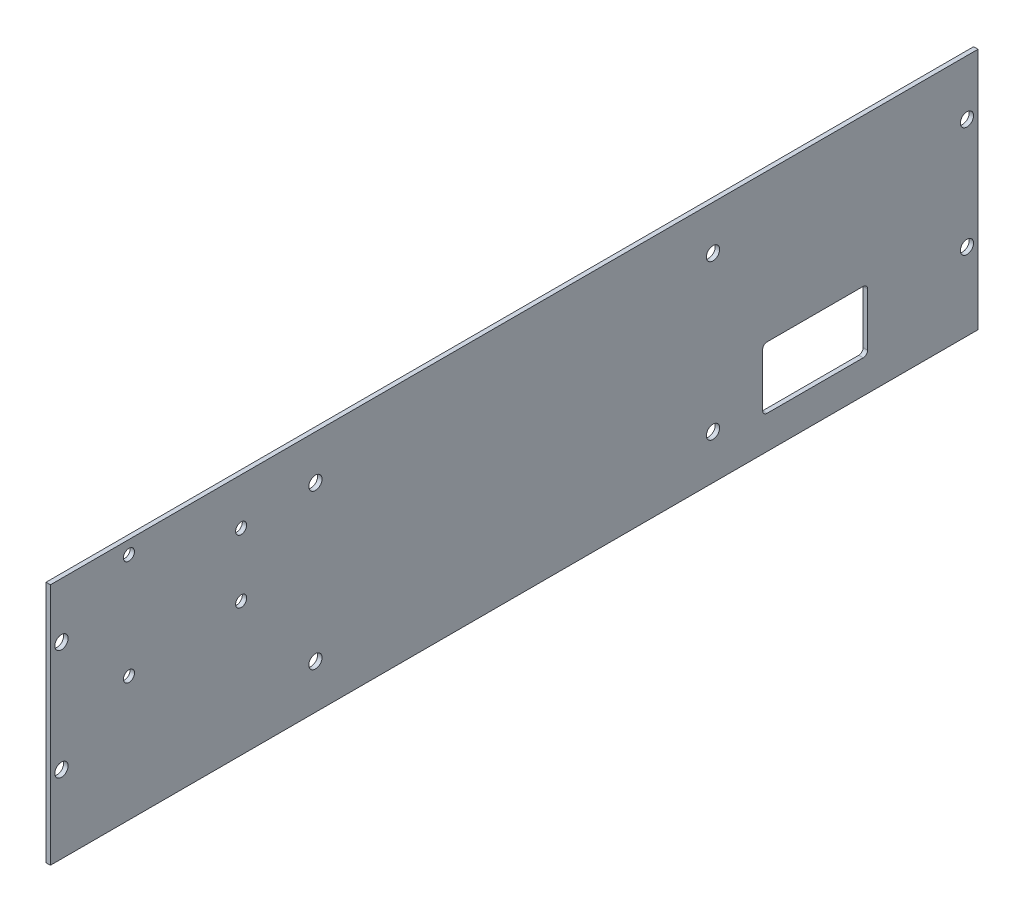
ISO-10303-21;
HEADER;
FILE_DESCRIPTION(('STEP AP214'),'2;1');
FILE_NAME('part.step','',(''),(''),'','','');
FILE_SCHEMA(('AUTOMOTIVE_DESIGN { 1 0 10303 214 1 1 1 1 }'));
ENDSEC;
DATA;
#1=APPLICATION_CONTEXT('core data for automotive mechanical design processes');
#2=APPLICATION_PROTOCOL_DEFINITION('international standard','automotive_design',2000,#1);
#3=PRODUCT_CONTEXT('',#1,'mechanical');
#4=PRODUCT('Part','Part','',(#3));
#5=PRODUCT_RELATED_PRODUCT_CATEGORY('part','',(#4));
#6=PRODUCT_DEFINITION_FORMATION('','',#4);
#7=PRODUCT_DEFINITION_CONTEXT('part definition',#1,'design');
#8=PRODUCT_DEFINITION('design','',#6,#7);
#9=PRODUCT_DEFINITION_SHAPE('','',#8);
#10=(LENGTH_UNIT() NAMED_UNIT(*) SI_UNIT(.MILLI.,.METRE.));
#11=(NAMED_UNIT(*) PLANE_ANGLE_UNIT() SI_UNIT($,.RADIAN.));
#12=(NAMED_UNIT(*) SI_UNIT($,.STERADIAN.) SOLID_ANGLE_UNIT());
#13=UNCERTAINTY_MEASURE_WITH_UNIT(LENGTH_MEASURE(1.E-05),#10,'distance_accuracy_value','');
#14=(GEOMETRIC_REPRESENTATION_CONTEXT(3) GLOBAL_UNCERTAINTY_ASSIGNED_CONTEXT((#13)) GLOBAL_UNIT_ASSIGNED_CONTEXT((#10,
#11,#12)) REPRESENTATION_CONTEXT('',''));
#15=CARTESIAN_POINT('',(0.,0.,0.));
#16=DIRECTION('',(0.,0.,1.));
#17=DIRECTION('',(1.,0.,0.));
#18=AXIS2_PLACEMENT_3D('',#15,#16,#17);
#19=CARTESIAN_POINT('',(-28.0517455341106,100.,394.692172038795));
#20=DIRECTION('',(0.,0.,-1.));
#21=DIRECTION('',(-1.,0.,0.));
#22=AXIS2_PLACEMENT_3D('',#19,#20,#21);
#23=PLANE('',#22);
#24=DIRECTION('',(0.,1.,0.));
#25=VECTOR('',#24,1.);
#26=CARTESIAN_POINT('',(-26.0517455341106,100.,394.692172038795));
#27=LINE('',#26,#25);
#28=CARTESIAN_POINT('',(-26.0517455341106,-10.,394.692172038795));
#29=VERTEX_POINT('',#28);
#30=CARTESIAN_POINT('',(-26.0517455341106,100.,394.692172038795));
#31=VERTEX_POINT('',#30);
#32=EDGE_CURVE('E145',#29,#31,#27,.T.);
#33=ORIENTED_EDGE('',*,*,#32,.T.);
#34=DIRECTION('',(1.,0.,0.));
#35=VECTOR('',#34,1.);
#36=CARTESIAN_POINT('',(-28.0517455341106,100.,394.692172038795));
#37=LINE('',#36,#35);
#38=CARTESIAN_POINT('',(-28.0517455341106,100.,394.692172038795));
#39=VERTEX_POINT('',#38);
#40=EDGE_CURVE('E126',#39,#31,#37,.T.);
#41=ORIENTED_EDGE('',*,*,#40,.F.);
#42=DIRECTION('',(0.,1.,0.));
#43=VECTOR('',#42,1.);
#44=CARTESIAN_POINT('',(-28.0517455341106,100.,394.692172038795));
#45=LINE('',#44,#43);
#46=CARTESIAN_POINT('',(-28.0517455341106,-10.,394.692172038795));
#47=VERTEX_POINT('',#46);
#48=EDGE_CURVE('E133',#47,#39,#45,.T.);
#49=ORIENTED_EDGE('',*,*,#48,.F.);
#50=DIRECTION('',(1.,0.,0.));
#51=VECTOR('',#50,1.);
#52=CARTESIAN_POINT('',(-28.0517455341106,-10.,394.692172038795));
#53=LINE('',#52,#51);
#54=EDGE_CURVE('E290',#47,#29,#53,.T.);
#55=ORIENTED_EDGE('',*,*,#54,.T.);
#56=EDGE_LOOP('',(#33,#41,#49,#55));
#57=FACE_BOUND('',#56,.T.);
#58=ADVANCED_FACE('F33',(#57),#23,.F.);
#59=CARTESIAN_POINT('',(-28.0517455341106,100.,394.692172038795));
#60=DIRECTION('',(0.,-1.,0.));
#61=DIRECTION('',(0.,0.,-1.));
#62=AXIS2_PLACEMENT_3D('',#59,#60,#61);
#63=PLANE('',#62);
#64=DIRECTION('',(0.,0.,-1.));
#65=VECTOR('',#64,1.);
#66=CARTESIAN_POINT('',(-26.0517455341106,100.,394.692172038795));
#67=LINE('',#66,#65);
#68=CARTESIAN_POINT('',(-26.0517455341106,99.9999999999999,-25.3078279612049));
#69=VERTEX_POINT('',#68);
#70=EDGE_CURVE('E292',#31,#69,#67,.T.);
#71=ORIENTED_EDGE('',*,*,#70,.T.);
#72=DIRECTION('',(1.,0.,0.));
#73=VECTOR('',#72,1.);
#74=CARTESIAN_POINT('',(-28.0517455341106,99.9999999999999,-25.3078279612049));
#75=LINE('',#74,#73);
#76=CARTESIAN_POINT('',(-28.0517455341106,99.9999999999999,-25.3078279612049));
#77=VERTEX_POINT('',#76);
#78=EDGE_CURVE('E129',#77,#69,#75,.T.);
#79=ORIENTED_EDGE('',*,*,#78,.F.);
#80=DIRECTION('',(0.,0.,-1.));
#81=VECTOR('',#80,1.);
#82=CARTESIAN_POINT('',(-28.0517455341106,100.,394.692172038795));
#83=LINE('',#82,#81);
#84=EDGE_CURVE('E122',#39,#77,#83,.T.);
#85=ORIENTED_EDGE('',*,*,#84,.F.);
#86=ORIENTED_EDGE('',*,*,#40,.T.);
#87=EDGE_LOOP('',(#71,#79,#85,#86));
#88=FACE_BOUND('',#87,.T.);
#89=ADVANCED_FACE('F124',(#88),#63,.F.);
#90=CARTESIAN_POINT('',(-28.0517455341106,99.9999999999999,-25.3078279612049));
#91=DIRECTION('',(0.,0.,1.));
#92=DIRECTION('',(0.,-1.,0.));
#93=AXIS2_PLACEMENT_3D('',#90,#91,#92);
#94=PLANE('',#93);
#95=DIRECTION('',(0.,-1.,0.));
#96=VECTOR('',#95,1.);
#97=CARTESIAN_POINT('',(-26.0517455341106,99.9999999999999,-25.3078279612049));
#98=LINE('',#97,#96);
#99=CARTESIAN_POINT('',(-26.0517455341106,-10.,-25.3078279612049));
#100=VERTEX_POINT('',#99);
#101=EDGE_CURVE('E294',#69,#100,#98,.T.);
#102=ORIENTED_EDGE('',*,*,#101,.T.);
#103=DIRECTION('',(1.,0.,0.));
#104=VECTOR('',#103,1.);
#105=CARTESIAN_POINT('',(-28.0517455341106,-10.,-25.3078279612049));
#106=LINE('',#105,#104);
#107=CARTESIAN_POINT('',(-28.0517455341106,-10.,-25.3078279612049));
#108=VERTEX_POINT('',#107);
#109=EDGE_CURVE('E150',#108,#100,#106,.T.);
#110=ORIENTED_EDGE('',*,*,#109,.F.);
#111=DIRECTION('',(0.,-1.,0.));
#112=VECTOR('',#111,1.);
#113=CARTESIAN_POINT('',(-28.0517455341106,99.9999999999999,-25.3078279612049));
#114=LINE('',#113,#112);
#115=EDGE_CURVE('E132',#77,#108,#114,.T.);
#116=ORIENTED_EDGE('',*,*,#115,.F.);
#117=ORIENTED_EDGE('',*,*,#78,.T.);
#118=EDGE_LOOP('',(#102,#110,#116,#117));
#119=FACE_BOUND('',#118,.T.);
#120=ADVANCED_FACE('F306',(#119),#94,.F.);
#121=CARTESIAN_POINT('',(-28.0517455341106,-10.,394.692172038795));
#122=DIRECTION('',(0.,1.,0.));
#123=DIRECTION('',(0.,0.,1.));
#124=AXIS2_PLACEMENT_3D('',#121,#122,#123);
#125=PLANE('',#124);
#126=DIRECTION('',(0.,0.,1.));
#127=VECTOR('',#126,1.);
#128=CARTESIAN_POINT('',(-26.0517455341106,-10.,394.692172038795));
#129=LINE('',#128,#127);
#130=EDGE_CURVE('E142',#100,#29,#129,.T.);
#131=ORIENTED_EDGE('',*,*,#130,.T.);
#132=ORIENTED_EDGE('',*,*,#54,.F.);
#133=DIRECTION('',(0.,0.,1.));
#134=VECTOR('',#133,1.);
#135=CARTESIAN_POINT('',(-28.0517455341106,-10.,394.692172038795));
#136=LINE('',#135,#134);
#137=EDGE_CURVE('E138',#108,#47,#136,.T.);
#138=ORIENTED_EDGE('',*,*,#137,.F.);
#139=ORIENTED_EDGE('',*,*,#109,.T.);
#140=EDGE_LOOP('',(#131,#132,#138,#139));
#141=FACE_BOUND('',#140,.T.);
#142=ADVANCED_FACE('F301',(#141),#125,.F.);
#143=CARTESIAN_POINT('',(-28.0517455341106,-10.,394.692172038795));
#144=DIRECTION('',(1.,0.,0.));
#145=DIRECTION('',(0.,0.,-1.));
#146=AXIS2_PLACEMENT_3D('',#143,#144,#145);
#147=PLANE('',#146);
#148=DIRECTION('',(0.,0.,1.));
#149=VECTOR('',#148,1.);
#150=CARTESIAN_POINT('',(-28.0517455341106,5.,24.6921720387951));
#151=LINE('',#150,#149);
#152=CARTESIAN_POINT('',(-28.0517455341106,5.,26.6921720387951));
#153=VERTEX_POINT('',#152);
#154=CARTESIAN_POINT('',(-28.0517455341106,5.,70.1921720387951));
#155=VERTEX_POINT('',#154);
#156=EDGE_CURVE('E204',#153,#155,#151,.T.);
#157=ORIENTED_EDGE('',*,*,#156,.F.);
#158=CARTESIAN_POINT('',(-28.0517455341106,7.,26.6921720387951));
#159=DIRECTION('',(1.,0.,0.));
#160=DIRECTION('',(0.,0.,-1.));
#161=AXIS2_PLACEMENT_3D('',#158,#159,#160);
#162=CIRCLE('',#161,2.);
#163=CARTESIAN_POINT('',(-28.0517455341106,7.,24.6921720387951));
#164=VERTEX_POINT('',#163);
#165=EDGE_CURVE('E178',#153,#164,#162,.T.);
#166=ORIENTED_EDGE('',*,*,#165,.T.);
#167=DIRECTION('',(0.,-1.,0.));
#168=VECTOR('',#167,1.);
#169=CARTESIAN_POINT('',(-28.0517455341106,33.,24.6921720387951));
#170=LINE('',#169,#168);
#171=CARTESIAN_POINT('',(-28.0517455341106,31.,24.6921720387951));
#172=VERTEX_POINT('',#171);
#173=EDGE_CURVE('E188',#172,#164,#170,.T.);
#174=ORIENTED_EDGE('',*,*,#173,.F.);
#175=CARTESIAN_POINT('',(-28.0517455341106,31.,26.6921720387951));
#176=DIRECTION('',(1.,0.,0.));
#177=DIRECTION('',(0.,0.,-1.));
#178=AXIS2_PLACEMENT_3D('',#175,#176,#177);
#179=CIRCLE('',#178,2.);
#180=CARTESIAN_POINT('',(-28.0517455341106,33.,26.6921720387951));
#181=VERTEX_POINT('',#180);
#182=EDGE_CURVE('E41',#172,#181,#179,.T.);
#183=ORIENTED_EDGE('',*,*,#182,.T.);
#184=DIRECTION('',(0.,0.,-1.));
#185=VECTOR('',#184,1.);
#186=CARTESIAN_POINT('',(-28.0517455341106,33.,24.6921720387951));
#187=LINE('',#186,#185);
#188=CARTESIAN_POINT('',(-28.0517455341106,33.,70.1921720387951));
#189=VERTEX_POINT('',#188);
#190=EDGE_CURVE('E187',#189,#181,#187,.T.);
#191=ORIENTED_EDGE('',*,*,#190,.F.);
#192=CARTESIAN_POINT('',(-28.0517455341106,31.,70.1921720387951));
#193=DIRECTION('',(1.,0.,0.));
#194=DIRECTION('',(0.,0.,-1.));
#195=AXIS2_PLACEMENT_3D('',#192,#193,#194);
#196=CIRCLE('',#195,2.);
#197=CARTESIAN_POINT('',(-28.0517455341106,31.,72.1921720387951));
#198=VERTEX_POINT('',#197);
#199=EDGE_CURVE('E174',#189,#198,#196,.T.);
#200=ORIENTED_EDGE('',*,*,#199,.T.);
#201=DIRECTION('',(0.,1.,0.));
#202=VECTOR('',#201,1.);
#203=CARTESIAN_POINT('',(-28.0517455341106,33.,72.1921720387951));
#204=LINE('',#203,#202);
#205=CARTESIAN_POINT('',(-28.0517455341106,7.,72.1921720387951));
#206=VERTEX_POINT('',#205);
#207=EDGE_CURVE('E197',#206,#198,#204,.T.);
#208=ORIENTED_EDGE('',*,*,#207,.F.);
#209=CARTESIAN_POINT('',(-28.0517455341106,7.,70.1921720387951));
#210=DIRECTION('',(1.,0.,0.));
#211=DIRECTION('',(0.,0.,-1.));
#212=AXIS2_PLACEMENT_3D('',#209,#210,#211);
#213=CIRCLE('',#212,2.);
#214=EDGE_CURVE('E170',#206,#155,#213,.T.);
#215=ORIENTED_EDGE('',*,*,#214,.T.);
#216=EDGE_LOOP('',(#157,#166,#174,#183,#191,#200,#208,#215));
#217=FACE_BOUND('',#216,.T.);
#218=CARTESIAN_POINT('',(-28.0517455341106,46.4,359.122629299602));
#219=DIRECTION('',(-1.,0.,0.));
#220=DIRECTION('',(0.,0.,1.));
#221=AXIS2_PLACEMENT_3D('',#218,#219,#220);
#222=CIRCLE('',#221,2.50000000000002);
#223=CARTESIAN_POINT('',(-28.0517455341106,46.4,361.622629299602));
#224=VERTEX_POINT('',#223);
#225=EDGE_CURVE('E217',#224,#224,#222,.T.);
#226=ORIENTED_EDGE('',*,*,#225,.F.);
#227=EDGE_LOOP('',(#226));
#228=FACE_BOUND('',#227,.T.);
#229=CARTESIAN_POINT('',(-28.0517455341106,50.4,308.322629299602));
#230=DIRECTION('',(-1.,0.,0.));
#231=DIRECTION('',(0.,0.,1.));
#232=AXIS2_PLACEMENT_3D('',#229,#230,#231);
#233=CIRCLE('',#232,2.50000000000002);
#234=CARTESIAN_POINT('',(-28.0517455341106,50.4,310.822629299602));
#235=VERTEX_POINT('',#234);
#236=EDGE_CURVE('E223',#235,#235,#233,.T.);
#237=ORIENTED_EDGE('',*,*,#236,.F.);
#238=EDGE_LOOP('',(#237));
#239=FACE_BOUND('',#238,.T.);
#240=CARTESIAN_POINT('',(-28.0517455341106,79.,308.322629299602));
#241=DIRECTION('',(-1.,0.,0.));
#242=DIRECTION('',(0.,0.,1.));
#243=AXIS2_PLACEMENT_3D('',#240,#241,#242);
#244=CIRCLE('',#243,2.50000000000002);
#245=CARTESIAN_POINT('',(-28.0517455341106,79.,310.822629299602));
#246=VERTEX_POINT('',#245);
#247=EDGE_CURVE('E229',#246,#246,#244,.T.);
#248=ORIENTED_EDGE('',*,*,#247,.F.);
#249=EDGE_LOOP('',(#248));
#250=FACE_BOUND('',#249,.T.);
#251=CARTESIAN_POINT('',(-28.0517455341106,94.,359.122629299602));
#252=DIRECTION('',(-1.,0.,0.));
#253=DIRECTION('',(0.,0.,1.));
#254=AXIS2_PLACEMENT_3D('',#251,#252,#253);
#255=CIRCLE('',#254,2.50000000000002);
#256=CARTESIAN_POINT('',(-28.0517455341106,94.,361.622629299602));
#257=VERTEX_POINT('',#256);
#258=EDGE_CURVE('E235',#257,#257,#255,.T.);
#259=ORIENTED_EDGE('',*,*,#258,.F.);
#260=EDGE_LOOP('',(#259));
#261=FACE_BOUND('',#260,.T.);
#262=CARTESIAN_POINT('',(-28.0517455341106,80.,274.692172038795));
#263=DIRECTION('',(-1.,0.,0.));
#264=DIRECTION('',(0.,0.,1.));
#265=AXIS2_PLACEMENT_3D('',#262,#263,#264);
#266=CIRCLE('',#265,2.99999999999999);
#267=CARTESIAN_POINT('',(-28.0517455341106,80.,277.692172038795));
#268=VERTEX_POINT('',#267);
#269=EDGE_CURVE('E241',#268,#268,#266,.T.);
#270=ORIENTED_EDGE('',*,*,#269,.F.);
#271=EDGE_LOOP('',(#270));
#272=FACE_BOUND('',#271,.T.);
#273=CARTESIAN_POINT('',(-28.0517455341106,80.,94.6921720387951));
#274=DIRECTION('',(-1.,0.,0.));
#275=DIRECTION('',(0.,0.,1.));
#276=AXIS2_PLACEMENT_3D('',#273,#274,#275);
#277=CIRCLE('',#276,3.00000000000001);
#278=CARTESIAN_POINT('',(-28.0517455341106,80.,97.6921720387951));
#279=VERTEX_POINT('',#278);
#280=EDGE_CURVE('E247',#279,#279,#277,.T.);
#281=ORIENTED_EDGE('',*,*,#280,.F.);
#282=EDGE_LOOP('',(#281));
#283=FACE_BOUND('',#282,.T.);
#284=CARTESIAN_POINT('',(-28.0517455341106,10.,274.692172038795));
#285=DIRECTION('',(-1.,0.,0.));
#286=DIRECTION('',(0.,0.,1.));
#287=AXIS2_PLACEMENT_3D('',#284,#285,#286);
#288=CIRCLE('',#287,2.99999999999999);
#289=CARTESIAN_POINT('',(-28.0517455341106,10.,277.692172038795));
#290=VERTEX_POINT('',#289);
#291=EDGE_CURVE('E253',#290,#290,#288,.T.);
#292=ORIENTED_EDGE('',*,*,#291,.F.);
#293=EDGE_LOOP('',(#292));
#294=FACE_BOUND('',#293,.T.);
#295=CARTESIAN_POINT('',(-28.0517455341106,10.,94.6921720387951));
#296=DIRECTION('',(-1.,0.,0.));
#297=DIRECTION('',(0.,0.,1.));
#298=AXIS2_PLACEMENT_3D('',#295,#296,#297);
#299=CIRCLE('',#298,3.00000000000001);
#300=CARTESIAN_POINT('',(-28.0517455341106,10.,97.6921720387951));
#301=VERTEX_POINT('',#300);
#302=EDGE_CURVE('E259',#301,#301,#299,.T.);
#303=ORIENTED_EDGE('',*,*,#302,.F.);
#304=EDGE_LOOP('',(#303));
#305=FACE_BOUND('',#304,.T.);
#306=CARTESIAN_POINT('',(-28.0517455341106,25.,389.692172038795));
#307=DIRECTION('',(-1.,0.,0.));
#308=DIRECTION('',(0.,0.,1.));
#309=AXIS2_PLACEMENT_3D('',#306,#307,#308);
#310=CIRCLE('',#309,2.99999999999999);
#311=CARTESIAN_POINT('',(-28.0517455341106,25.,392.692172038795));
#312=VERTEX_POINT('',#311);
#313=EDGE_CURVE('E265',#312,#312,#310,.T.);
#314=ORIENTED_EDGE('',*,*,#313,.F.);
#315=EDGE_LOOP('',(#314));
#316=FACE_BOUND('',#315,.T.);
#317=CARTESIAN_POINT('',(-28.0517455341106,75.,389.692172038795));
#318=DIRECTION('',(-1.,0.,0.));
#319=DIRECTION('',(0.,0.,1.));
#320=AXIS2_PLACEMENT_3D('',#317,#318,#319);
#321=CIRCLE('',#320,2.99999999999999);
#322=CARTESIAN_POINT('',(-28.0517455341106,75.,392.692172038795));
#323=VERTEX_POINT('',#322);
#324=EDGE_CURVE('E271',#323,#323,#321,.T.);
#325=ORIENTED_EDGE('',*,*,#324,.F.);
#326=EDGE_LOOP('',(#325));
#327=FACE_BOUND('',#326,.T.);
#328=CARTESIAN_POINT('',(-28.0517455341106,25.,-20.3078279612048));
#329=DIRECTION('',(-1.,0.,0.));
#330=DIRECTION('',(0.,0.,1.));
#331=AXIS2_PLACEMENT_3D('',#328,#329,#330);
#332=CIRCLE('',#331,3.);
#333=CARTESIAN_POINT('',(-28.0517455341106,25.,-17.3078279612048));
#334=VERTEX_POINT('',#333);
#335=EDGE_CURVE('E277',#334,#334,#332,.T.);
#336=ORIENTED_EDGE('',*,*,#335,.F.);
#337=EDGE_LOOP('',(#336));
#338=FACE_BOUND('',#337,.T.);
#339=CARTESIAN_POINT('',(-28.0517455341106,75.,-20.3078279612048));
#340=DIRECTION('',(-1.,0.,0.));
#341=DIRECTION('',(0.,0.,1.));
#342=AXIS2_PLACEMENT_3D('',#339,#340,#341);
#343=CIRCLE('',#342,3.);
#344=CARTESIAN_POINT('',(-28.0517455341106,75.,-17.3078279612048));
#345=VERTEX_POINT('',#344);
#346=EDGE_CURVE('E283',#345,#345,#343,.T.);
#347=ORIENTED_EDGE('',*,*,#346,.F.);
#348=EDGE_LOOP('',(#347));
#349=FACE_BOUND('',#348,.T.);
#350=ORIENTED_EDGE('',*,*,#48,.T.);
#351=ORIENTED_EDGE('',*,*,#84,.T.);
#352=ORIENTED_EDGE('',*,*,#115,.T.);
#353=ORIENTED_EDGE('',*,*,#137,.T.);
#354=EDGE_LOOP('',(#350,#351,#352,#353));
#355=FACE_BOUND('',#354,.T.);
#356=ADVANCED_FACE('F136',(#217,#228,#239,#250,#261,#272,#283,#294,#305,#316,#327,#338,#349,
#355),#147,.F.);
#357=CARTESIAN_POINT('',(-26.0517455341106,-10.,394.692172038795));
#358=DIRECTION('',(1.,0.,0.));
#359=DIRECTION('',(0.,0.,-1.));
#360=AXIS2_PLACEMENT_3D('',#357,#358,#359);
#361=PLANE('',#360);
#362=DIRECTION('',(0.,0.,-1.));
#363=VECTOR('',#362,1.);
#364=CARTESIAN_POINT('',(-26.0517455341106,33.,24.6921720387951));
#365=LINE('',#364,#363);
#366=CARTESIAN_POINT('',(-26.0517455341106,33.,70.1921720387951));
#367=VERTEX_POINT('',#366);
#368=CARTESIAN_POINT('',(-26.0517455341106,33.,26.6921720387951));
#369=VERTEX_POINT('',#368);
#370=EDGE_CURVE('E202',#367,#369,#365,.T.);
#371=ORIENTED_EDGE('',*,*,#370,.T.);
#372=CARTESIAN_POINT('',(-26.0517455341106,31.,26.6921720387951));
#373=DIRECTION('',(1.,0.,0.));
#374=DIRECTION('',(0.,0.,-1.));
#375=AXIS2_PLACEMENT_3D('',#372,#373,#374);
#376=CIRCLE('',#375,2.);
#377=CARTESIAN_POINT('',(-26.0517455341106,31.,24.6921720387951));
#378=VERTEX_POINT('',#377);
#379=EDGE_CURVE('E11',#369,#378,#376,.F.);
#380=ORIENTED_EDGE('',*,*,#379,.T.);
#381=DIRECTION('',(0.,-1.,0.));
#382=VECTOR('',#381,1.);
#383=CARTESIAN_POINT('',(-26.0517455341106,33.,24.6921720387951));
#384=LINE('',#383,#382);
#385=CARTESIAN_POINT('',(-26.0517455341106,7.,24.6921720387951));
#386=VERTEX_POINT('',#385);
#387=EDGE_CURVE('E200',#378,#386,#384,.T.);
#388=ORIENTED_EDGE('',*,*,#387,.T.);
#389=CARTESIAN_POINT('',(-26.0517455341106,7.,26.6921720387951));
#390=DIRECTION('',(1.,0.,0.));
#391=DIRECTION('',(0.,0.,-1.));
#392=AXIS2_PLACEMENT_3D('',#389,#390,#391);
#393=CIRCLE('',#392,2.);
#394=CARTESIAN_POINT('',(-26.0517455341106,5.,26.6921720387951));
#395=VERTEX_POINT('',#394);
#396=EDGE_CURVE('E180',#386,#395,#393,.F.);
#397=ORIENTED_EDGE('',*,*,#396,.T.);
#398=DIRECTION('',(0.,0.,1.));
#399=VECTOR('',#398,1.);
#400=CARTESIAN_POINT('',(-26.0517455341106,5.,24.6921720387951));
#401=LINE('',#400,#399);
#402=CARTESIAN_POINT('',(-26.0517455341106,5.,70.1921720387951));
#403=VERTEX_POINT('',#402);
#404=EDGE_CURVE('E196',#395,#403,#401,.T.);
#405=ORIENTED_EDGE('',*,*,#404,.T.);
#406=CARTESIAN_POINT('',(-26.0517455341106,7.,70.1921720387951));
#407=DIRECTION('',(1.,0.,0.));
#408=DIRECTION('',(0.,0.,-1.));
#409=AXIS2_PLACEMENT_3D('',#406,#407,#408);
#410=CIRCLE('',#409,2.);
#411=CARTESIAN_POINT('',(-26.0517455341106,7.,72.1921720387951));
#412=VERTEX_POINT('',#411);
#413=EDGE_CURVE('E172',#403,#412,#410,.F.);
#414=ORIENTED_EDGE('',*,*,#413,.T.);
#415=DIRECTION('',(0.,1.,0.));
#416=VECTOR('',#415,1.);
#417=CARTESIAN_POINT('',(-26.0517455341106,33.,72.1921720387951));
#418=LINE('',#417,#416);
#419=CARTESIAN_POINT('',(-26.0517455341106,31.,72.1921720387951));
#420=VERTEX_POINT('',#419);
#421=EDGE_CURVE('E206',#412,#420,#418,.T.);
#422=ORIENTED_EDGE('',*,*,#421,.T.);
#423=CARTESIAN_POINT('',(-26.0517455341106,31.,70.1921720387951));
#424=DIRECTION('',(1.,0.,0.));
#425=DIRECTION('',(0.,0.,-1.));
#426=AXIS2_PLACEMENT_3D('',#423,#424,#425);
#427=CIRCLE('',#426,2.);
#428=EDGE_CURVE('E176',#420,#367,#427,.F.);
#429=ORIENTED_EDGE('',*,*,#428,.T.);
#430=EDGE_LOOP('',(#371,#380,#388,#397,#405,#414,#422,#429));
#431=FACE_BOUND('',#430,.T.);
#432=CARTESIAN_POINT('',(-26.0517455341106,46.4,359.122629299602));
#433=DIRECTION('',(1.,0.,0.));
#434=DIRECTION('',(0.,0.,-1.));
#435=AXIS2_PLACEMENT_3D('',#432,#433,#434);
#436=CIRCLE('',#435,2.50000000000002);
#437=CARTESIAN_POINT('',(-26.0517455341106,46.4,356.622629299602));
#438=VERTEX_POINT('',#437);
#439=EDGE_CURVE('E216',#438,#438,#436,.F.);
#440=ORIENTED_EDGE('',*,*,#439,.T.);
#441=EDGE_LOOP('',(#440));
#442=FACE_BOUND('',#441,.T.);
#443=CARTESIAN_POINT('',(-26.0517455341106,50.4,308.322629299602));
#444=DIRECTION('',(1.,0.,0.));
#445=DIRECTION('',(0.,0.,-1.));
#446=AXIS2_PLACEMENT_3D('',#443,#444,#445);
#447=CIRCLE('',#446,2.50000000000002);
#448=CARTESIAN_POINT('',(-26.0517455341106,50.4,305.822629299602));
#449=VERTEX_POINT('',#448);
#450=EDGE_CURVE('E220',#449,#449,#447,.F.);
#451=ORIENTED_EDGE('',*,*,#450,.T.);
#452=EDGE_LOOP('',(#451));
#453=FACE_BOUND('',#452,.T.);
#454=CARTESIAN_POINT('',(-26.0517455341106,79.,308.322629299602));
#455=DIRECTION('',(1.,0.,0.));
#456=DIRECTION('',(0.,0.,-1.));
#457=AXIS2_PLACEMENT_3D('',#454,#455,#456);
#458=CIRCLE('',#457,2.50000000000002);
#459=CARTESIAN_POINT('',(-26.0517455341106,79.,305.822629299602));
#460=VERTEX_POINT('',#459);
#461=EDGE_CURVE('E226',#460,#460,#458,.F.);
#462=ORIENTED_EDGE('',*,*,#461,.T.);
#463=EDGE_LOOP('',(#462));
#464=FACE_BOUND('',#463,.T.);
#465=CARTESIAN_POINT('',(-26.0517455341106,94.,359.122629299602));
#466=DIRECTION('',(1.,0.,0.));
#467=DIRECTION('',(0.,0.,-1.));
#468=AXIS2_PLACEMENT_3D('',#465,#466,#467);
#469=CIRCLE('',#468,2.50000000000002);
#470=CARTESIAN_POINT('',(-26.0517455341106,94.,356.622629299602));
#471=VERTEX_POINT('',#470);
#472=EDGE_CURVE('E232',#471,#471,#469,.F.);
#473=ORIENTED_EDGE('',*,*,#472,.T.);
#474=EDGE_LOOP('',(#473));
#475=FACE_BOUND('',#474,.T.);
#476=CARTESIAN_POINT('',(-26.0517455341106,80.,274.692172038795));
#477=DIRECTION('',(1.,0.,0.));
#478=DIRECTION('',(0.,0.,-1.));
#479=AXIS2_PLACEMENT_3D('',#476,#477,#478);
#480=CIRCLE('',#479,2.99999999999999);
#481=CARTESIAN_POINT('',(-26.0517455341106,80.,271.692172038795));
#482=VERTEX_POINT('',#481);
#483=EDGE_CURVE('E238',#482,#482,#480,.F.);
#484=ORIENTED_EDGE('',*,*,#483,.T.);
#485=EDGE_LOOP('',(#484));
#486=FACE_BOUND('',#485,.T.);
#487=CARTESIAN_POINT('',(-26.0517455341106,80.,94.6921720387951));
#488=DIRECTION('',(1.,0.,0.));
#489=DIRECTION('',(0.,0.,-1.));
#490=AXIS2_PLACEMENT_3D('',#487,#488,#489);
#491=CIRCLE('',#490,3.00000000000001);
#492=CARTESIAN_POINT('',(-26.0517455341106,80.,91.6921720387951));
#493=VERTEX_POINT('',#492);
#494=EDGE_CURVE('E244',#493,#493,#491,.F.);
#495=ORIENTED_EDGE('',*,*,#494,.T.);
#496=EDGE_LOOP('',(#495));
#497=FACE_BOUND('',#496,.T.);
#498=CARTESIAN_POINT('',(-26.0517455341106,10.,274.692172038795));
#499=DIRECTION('',(1.,0.,0.));
#500=DIRECTION('',(0.,0.,-1.));
#501=AXIS2_PLACEMENT_3D('',#498,#499,#500);
#502=CIRCLE('',#501,2.99999999999999);
#503=CARTESIAN_POINT('',(-26.0517455341106,10.,271.692172038795));
#504=VERTEX_POINT('',#503);
#505=EDGE_CURVE('E250',#504,#504,#502,.F.);
#506=ORIENTED_EDGE('',*,*,#505,.T.);
#507=EDGE_LOOP('',(#506));
#508=FACE_BOUND('',#507,.T.);
#509=CARTESIAN_POINT('',(-26.0517455341106,10.,94.6921720387951));
#510=DIRECTION('',(1.,0.,0.));
#511=DIRECTION('',(0.,0.,-1.));
#512=AXIS2_PLACEMENT_3D('',#509,#510,#511);
#513=CIRCLE('',#512,3.00000000000001);
#514=CARTESIAN_POINT('',(-26.0517455341106,10.,91.6921720387951));
#515=VERTEX_POINT('',#514);
#516=EDGE_CURVE('E256',#515,#515,#513,.F.);
#517=ORIENTED_EDGE('',*,*,#516,.T.);
#518=EDGE_LOOP('',(#517));
#519=FACE_BOUND('',#518,.T.);
#520=CARTESIAN_POINT('',(-26.0517455341106,25.,389.692172038795));
#521=DIRECTION('',(1.,0.,0.));
#522=DIRECTION('',(0.,0.,-1.));
#523=AXIS2_PLACEMENT_3D('',#520,#521,#522);
#524=CIRCLE('',#523,2.99999999999999);
#525=CARTESIAN_POINT('',(-26.0517455341106,25.,386.692172038795));
#526=VERTEX_POINT('',#525);
#527=EDGE_CURVE('E262',#526,#526,#524,.F.);
#528=ORIENTED_EDGE('',*,*,#527,.T.);
#529=EDGE_LOOP('',(#528));
#530=FACE_BOUND('',#529,.T.);
#531=CARTESIAN_POINT('',(-26.0517455341106,75.,389.692172038795));
#532=DIRECTION('',(1.,0.,0.));
#533=DIRECTION('',(0.,0.,-1.));
#534=AXIS2_PLACEMENT_3D('',#531,#532,#533);
#535=CIRCLE('',#534,2.99999999999999);
#536=CARTESIAN_POINT('',(-26.0517455341106,75.,386.692172038795));
#537=VERTEX_POINT('',#536);
#538=EDGE_CURVE('E268',#537,#537,#535,.F.);
#539=ORIENTED_EDGE('',*,*,#538,.T.);
#540=EDGE_LOOP('',(#539));
#541=FACE_BOUND('',#540,.T.);
#542=CARTESIAN_POINT('',(-26.0517455341106,25.,-20.3078279612048));
#543=DIRECTION('',(1.,0.,0.));
#544=DIRECTION('',(0.,0.,-1.));
#545=AXIS2_PLACEMENT_3D('',#542,#543,#544);
#546=CIRCLE('',#545,3.);
#547=CARTESIAN_POINT('',(-26.0517455341106,25.,-23.3078279612048));
#548=VERTEX_POINT('',#547);
#549=EDGE_CURVE('E274',#548,#548,#546,.F.);
#550=ORIENTED_EDGE('',*,*,#549,.T.);
#551=EDGE_LOOP('',(#550));
#552=FACE_BOUND('',#551,.T.);
#553=CARTESIAN_POINT('',(-26.0517455341106,75.,-20.3078279612048));
#554=DIRECTION('',(1.,0.,0.));
#555=DIRECTION('',(0.,0.,-1.));
#556=AXIS2_PLACEMENT_3D('',#553,#554,#555);
#557=CIRCLE('',#556,3.);
#558=CARTESIAN_POINT('',(-26.0517455341106,75.,-23.3078279612048));
#559=VERTEX_POINT('',#558);
#560=EDGE_CURVE('E280',#559,#559,#557,.F.);
#561=ORIENTED_EDGE('',*,*,#560,.T.);
#562=EDGE_LOOP('',(#561));
#563=FACE_BOUND('',#562,.T.);
#564=ORIENTED_EDGE('',*,*,#32,.F.);
#565=ORIENTED_EDGE('',*,*,#130,.F.);
#566=ORIENTED_EDGE('',*,*,#101,.F.);
#567=ORIENTED_EDGE('',*,*,#70,.F.);
#568=EDGE_LOOP('',(#564,#565,#566,#567));
#569=FACE_BOUND('',#568,.T.);
#570=ADVANCED_FACE('F305',(#431,#442,#453,#464,#475,#486,#497,#508,#519,#530,#541,#552,#563,
#569),#361,.T.);
#571=CARTESIAN_POINT('',(-26.0507455341106,75.,-20.3078279612048));
#572=DIRECTION('',(-1.,0.,0.));
#573=DIRECTION('',(0.,0.,1.));
#574=AXIS2_PLACEMENT_3D('',#571,#572,#573);
#575=CYLINDRICAL_SURFACE('',#574,3.);
#576=ORIENTED_EDGE('',*,*,#560,.F.);
#577=EDGE_LOOP('',(#576));
#578=FACE_BOUND('',#577,.T.);
#579=ORIENTED_EDGE('',*,*,#346,.T.);
#580=EDGE_LOOP('',(#579));
#581=FACE_BOUND('',#580,.T.);
#582=ADVANCED_FACE('F402',(#578,#581),#575,.F.);
#583=CARTESIAN_POINT('',(-26.0507455341106,25.,-20.3078279612048));
#584=DIRECTION('',(-1.,0.,0.));
#585=DIRECTION('',(0.,0.,1.));
#586=AXIS2_PLACEMENT_3D('',#583,#584,#585);
#587=CYLINDRICAL_SURFACE('',#586,3.);
#588=ORIENTED_EDGE('',*,*,#549,.F.);
#589=EDGE_LOOP('',(#588));
#590=FACE_BOUND('',#589,.T.);
#591=ORIENTED_EDGE('',*,*,#335,.T.);
#592=EDGE_LOOP('',(#591));
#593=FACE_BOUND('',#592,.T.);
#594=ADVANCED_FACE('F398',(#590,#593),#587,.F.);
#595=CARTESIAN_POINT('',(-26.0507455341106,75.,389.692172038795));
#596=DIRECTION('',(-1.,0.,0.));
#597=DIRECTION('',(0.,0.,1.));
#598=AXIS2_PLACEMENT_3D('',#595,#596,#597);
#599=CYLINDRICAL_SURFACE('',#598,2.99999999999999);
#600=ORIENTED_EDGE('',*,*,#538,.F.);
#601=EDGE_LOOP('',(#600));
#602=FACE_BOUND('',#601,.T.);
#603=ORIENTED_EDGE('',*,*,#324,.T.);
#604=EDGE_LOOP('',(#603));
#605=FACE_BOUND('',#604,.T.);
#606=ADVANCED_FACE('F394',(#602,#605),#599,.F.);
#607=CARTESIAN_POINT('',(-26.0507455341106,25.,389.692172038795));
#608=DIRECTION('',(-1.,0.,0.));
#609=DIRECTION('',(0.,0.,1.));
#610=AXIS2_PLACEMENT_3D('',#607,#608,#609);
#611=CYLINDRICAL_SURFACE('',#610,2.99999999999999);
#612=ORIENTED_EDGE('',*,*,#527,.F.);
#613=EDGE_LOOP('',(#612));
#614=FACE_BOUND('',#613,.T.);
#615=ORIENTED_EDGE('',*,*,#313,.T.);
#616=EDGE_LOOP('',(#615));
#617=FACE_BOUND('',#616,.T.);
#618=ADVANCED_FACE('F390',(#614,#617),#611,.F.);
#619=CARTESIAN_POINT('',(-26.0507455341106,10.,94.6921720387951));
#620=DIRECTION('',(-1.,0.,0.));
#621=DIRECTION('',(0.,0.,1.));
#622=AXIS2_PLACEMENT_3D('',#619,#620,#621);
#623=CYLINDRICAL_SURFACE('',#622,3.00000000000001);
#624=ORIENTED_EDGE('',*,*,#516,.F.);
#625=EDGE_LOOP('',(#624));
#626=FACE_BOUND('',#625,.T.);
#627=ORIENTED_EDGE('',*,*,#302,.T.);
#628=EDGE_LOOP('',(#627));
#629=FACE_BOUND('',#628,.T.);
#630=ADVANCED_FACE('F386',(#626,#629),#623,.F.);
#631=CARTESIAN_POINT('',(-26.0507455341106,10.,274.692172038795));
#632=DIRECTION('',(-1.,0.,0.));
#633=DIRECTION('',(0.,0.,1.));
#634=AXIS2_PLACEMENT_3D('',#631,#632,#633);
#635=CYLINDRICAL_SURFACE('',#634,2.99999999999999);
#636=ORIENTED_EDGE('',*,*,#505,.F.);
#637=EDGE_LOOP('',(#636));
#638=FACE_BOUND('',#637,.T.);
#639=ORIENTED_EDGE('',*,*,#291,.T.);
#640=EDGE_LOOP('',(#639));
#641=FACE_BOUND('',#640,.T.);
#642=ADVANCED_FACE('F382',(#638,#641),#635,.F.);
#643=CARTESIAN_POINT('',(-26.0507455341106,80.,94.6921720387951));
#644=DIRECTION('',(-1.,0.,0.));
#645=DIRECTION('',(0.,0.,1.));
#646=AXIS2_PLACEMENT_3D('',#643,#644,#645);
#647=CYLINDRICAL_SURFACE('',#646,3.00000000000001);
#648=ORIENTED_EDGE('',*,*,#494,.F.);
#649=EDGE_LOOP('',(#648));
#650=FACE_BOUND('',#649,.T.);
#651=ORIENTED_EDGE('',*,*,#280,.T.);
#652=EDGE_LOOP('',(#651));
#653=FACE_BOUND('',#652,.T.);
#654=ADVANCED_FACE('F378',(#650,#653),#647,.F.);
#655=CARTESIAN_POINT('',(-26.0507455341106,80.,274.692172038795));
#656=DIRECTION('',(-1.,0.,0.));
#657=DIRECTION('',(0.,0.,1.));
#658=AXIS2_PLACEMENT_3D('',#655,#656,#657);
#659=CYLINDRICAL_SURFACE('',#658,2.99999999999999);
#660=ORIENTED_EDGE('',*,*,#483,.F.);
#661=EDGE_LOOP('',(#660));
#662=FACE_BOUND('',#661,.T.);
#663=ORIENTED_EDGE('',*,*,#269,.T.);
#664=EDGE_LOOP('',(#663));
#665=FACE_BOUND('',#664,.T.);
#666=ADVANCED_FACE('F374',(#662,#665),#659,.F.);
#667=CARTESIAN_POINT('',(-26.0507455341106,94.,359.122629299602));
#668=DIRECTION('',(-1.,0.,0.));
#669=DIRECTION('',(0.,0.,1.));
#670=AXIS2_PLACEMENT_3D('',#667,#668,#669);
#671=CYLINDRICAL_SURFACE('',#670,2.50000000000002);
#672=ORIENTED_EDGE('',*,*,#472,.F.);
#673=EDGE_LOOP('',(#672));
#674=FACE_BOUND('',#673,.T.);
#675=ORIENTED_EDGE('',*,*,#258,.T.);
#676=EDGE_LOOP('',(#675));
#677=FACE_BOUND('',#676,.T.);
#678=ADVANCED_FACE('F370',(#674,#677),#671,.F.);
#679=CARTESIAN_POINT('',(-26.0507455341106,79.,308.322629299602));
#680=DIRECTION('',(-1.,0.,0.));
#681=DIRECTION('',(0.,0.,1.));
#682=AXIS2_PLACEMENT_3D('',#679,#680,#681);
#683=CYLINDRICAL_SURFACE('',#682,2.50000000000002);
#684=ORIENTED_EDGE('',*,*,#461,.F.);
#685=EDGE_LOOP('',(#684));
#686=FACE_BOUND('',#685,.T.);
#687=ORIENTED_EDGE('',*,*,#247,.T.);
#688=EDGE_LOOP('',(#687));
#689=FACE_BOUND('',#688,.T.);
#690=ADVANCED_FACE('F366',(#686,#689),#683,.F.);
#691=CARTESIAN_POINT('',(-26.0507455341106,50.4,308.322629299602));
#692=DIRECTION('',(-1.,0.,0.));
#693=DIRECTION('',(0.,0.,1.));
#694=AXIS2_PLACEMENT_3D('',#691,#692,#693);
#695=CYLINDRICAL_SURFACE('',#694,2.50000000000002);
#696=ORIENTED_EDGE('',*,*,#450,.F.);
#697=EDGE_LOOP('',(#696));
#698=FACE_BOUND('',#697,.T.);
#699=ORIENTED_EDGE('',*,*,#236,.T.);
#700=EDGE_LOOP('',(#699));
#701=FACE_BOUND('',#700,.T.);
#702=ADVANCED_FACE('F362',(#698,#701),#695,.F.);
#703=CARTESIAN_POINT('',(-26.0507455341106,46.4,359.122629299602));
#704=DIRECTION('',(-1.,0.,0.));
#705=DIRECTION('',(0.,0.,1.));
#706=AXIS2_PLACEMENT_3D('',#703,#704,#705);
#707=CYLINDRICAL_SURFACE('',#706,2.50000000000002);
#708=ORIENTED_EDGE('',*,*,#439,.F.);
#709=EDGE_LOOP('',(#708));
#710=FACE_BOUND('',#709,.T.);
#711=ORIENTED_EDGE('',*,*,#225,.T.);
#712=EDGE_LOOP('',(#711));
#713=FACE_BOUND('',#712,.T.);
#714=ADVANCED_FACE('F359',(#710,#713),#707,.F.);
#715=CARTESIAN_POINT('',(-26.0507455341106,33.,24.6921720387951));
#716=DIRECTION('',(0.,0.,-1.));
#717=DIRECTION('',(0.,1.,0.));
#718=AXIS2_PLACEMENT_3D('',#715,#716,#717);
#719=PLANE('',#718);
#720=ORIENTED_EDGE('',*,*,#173,.T.);
#721=DIRECTION('',(-1.,0.,0.));
#722=VECTOR('',#721,1.);
#723=CARTESIAN_POINT('',(-26.0517455341106,7.,24.6921720387951));
#724=LINE('',#723,#722);
#725=EDGE_CURVE('E48',#164,#386,#724,.F.);
#726=ORIENTED_EDGE('',*,*,#725,.T.);
#727=ORIENTED_EDGE('',*,*,#387,.F.);
#728=DIRECTION('',(-1.,0.,0.));
#729=VECTOR('',#728,1.);
#730=CARTESIAN_POINT('',(-28.0517455341106,31.,24.6921720387951));
#731=LINE('',#730,#729);
#732=EDGE_CURVE('E166',#378,#172,#731,.T.);
#733=ORIENTED_EDGE('',*,*,#732,.T.);
#734=EDGE_LOOP('',(#720,#726,#727,#733));
#735=FACE_BOUND('',#734,.T.);
#736=ADVANCED_FACE('F199',(#735),#719,.F.);
#737=CARTESIAN_POINT('',(-26.0507455341106,33.,24.6921720387951));
#738=DIRECTION('',(0.,1.,0.));
#739=DIRECTION('',(0.,0.,1.));
#740=AXIS2_PLACEMENT_3D('',#737,#738,#739);
#741=PLANE('',#740);
#742=ORIENTED_EDGE('',*,*,#370,.F.);
#743=DIRECTION('',(-1.,0.,0.));
#744=VECTOR('',#743,1.);
#745=CARTESIAN_POINT('',(-28.0517455341106,33.,70.1921720387951));
#746=LINE('',#745,#744);
#747=EDGE_CURVE('E163',#367,#189,#746,.T.);
#748=ORIENTED_EDGE('',*,*,#747,.T.);
#749=ORIENTED_EDGE('',*,*,#190,.T.);
#750=DIRECTION('',(-1.,0.,0.));
#751=VECTOR('',#750,1.);
#752=CARTESIAN_POINT('',(-26.0517455341106,33.,26.6921720387951));
#753=LINE('',#752,#751);
#754=EDGE_CURVE('E161',#181,#369,#753,.F.);
#755=ORIENTED_EDGE('',*,*,#754,.T.);
#756=EDGE_LOOP('',(#742,#748,#749,#755));
#757=FACE_BOUND('',#756,.T.);
#758=ADVANCED_FACE('F194',(#757),#741,.F.);
#759=CARTESIAN_POINT('',(-26.0507455341106,33.,72.1921720387951));
#760=DIRECTION('',(0.,0.,1.));
#761=DIRECTION('',(1.,0.,0.));
#762=AXIS2_PLACEMENT_3D('',#759,#760,#761);
#763=PLANE('',#762);
#764=ORIENTED_EDGE('',*,*,#421,.F.);
#765=DIRECTION('',(-1.,0.,0.));
#766=VECTOR('',#765,1.);
#767=CARTESIAN_POINT('',(-28.0517455341106,7.,72.1921720387951));
#768=LINE('',#767,#766);
#769=EDGE_CURVE('E148',#412,#206,#768,.T.);
#770=ORIENTED_EDGE('',*,*,#769,.T.);
#771=ORIENTED_EDGE('',*,*,#207,.T.);
#772=DIRECTION('',(-1.,0.,0.));
#773=VECTOR('',#772,1.);
#774=CARTESIAN_POINT('',(-26.0517455341106,31.,72.1921720387951));
#775=LINE('',#774,#773);
#776=EDGE_CURVE('E146',#198,#420,#775,.F.);
#777=ORIENTED_EDGE('',*,*,#776,.T.);
#778=EDGE_LOOP('',(#764,#770,#771,#777));
#779=FACE_BOUND('',#778,.T.);
#780=ADVANCED_FACE('F345',(#779),#763,.F.);
#781=CARTESIAN_POINT('',(-26.0507455341106,5.,24.6921720387951));
#782=DIRECTION('',(0.,-1.,0.));
#783=DIRECTION('',(0.,0.,-1.));
#784=AXIS2_PLACEMENT_3D('',#781,#782,#783);
#785=PLANE('',#784);
#786=ORIENTED_EDGE('',*,*,#156,.T.);
#787=DIRECTION('',(-1.,0.,0.));
#788=VECTOR('',#787,1.);
#789=CARTESIAN_POINT('',(-26.0517455341106,5.,70.1921720387951));
#790=LINE('',#789,#788);
#791=EDGE_CURVE('E159',#155,#403,#790,.F.);
#792=ORIENTED_EDGE('',*,*,#791,.T.);
#793=ORIENTED_EDGE('',*,*,#404,.F.);
#794=DIRECTION('',(-1.,0.,0.));
#795=VECTOR('',#794,1.);
#796=CARTESIAN_POINT('',(-28.0517455341106,5.,26.6921720387951));
#797=LINE('',#796,#795);
#798=EDGE_CURVE('E156',#395,#153,#797,.T.);
#799=ORIENTED_EDGE('',*,*,#798,.T.);
#800=EDGE_LOOP('',(#786,#792,#793,#799));
#801=FACE_BOUND('',#800,.T.);
#802=ADVANCED_FACE('F324',(#801),#785,.F.);
#803=CARTESIAN_POINT('',(-26.0507455341106,7.,70.1921720387951));
#804=DIRECTION('',(1.,0.,0.));
#805=DIRECTION('',(0.,0.,-1.));
#806=AXIS2_PLACEMENT_3D('',#803,#804,#805);
#807=CYLINDRICAL_SURFACE('',#806,2.);
#808=ORIENTED_EDGE('',*,*,#413,.F.);
#809=ORIENTED_EDGE('',*,*,#791,.F.);
#810=ORIENTED_EDGE('',*,*,#214,.F.);
#811=ORIENTED_EDGE('',*,*,#769,.F.);
#812=EDGE_LOOP('',(#808,#809,#810,#811));
#813=FACE_BOUND('',#812,.T.);
#814=ADVANCED_FACE('F320',(#813),#807,.F.);
#815=CARTESIAN_POINT('',(-26.0507455341106,31.,70.1921720387951));
#816=DIRECTION('',(1.,0.,0.));
#817=DIRECTION('',(0.,0.,-1.));
#818=AXIS2_PLACEMENT_3D('',#815,#816,#817);
#819=CYLINDRICAL_SURFACE('',#818,2.);
#820=ORIENTED_EDGE('',*,*,#428,.F.);
#821=ORIENTED_EDGE('',*,*,#776,.F.);
#822=ORIENTED_EDGE('',*,*,#199,.F.);
#823=ORIENTED_EDGE('',*,*,#747,.F.);
#824=EDGE_LOOP('',(#820,#821,#822,#823));
#825=FACE_BOUND('',#824,.T.);
#826=ADVANCED_FACE('F323',(#825),#819,.F.);
#827=CARTESIAN_POINT('',(-26.0507455341106,7.,26.6921720387951));
#828=DIRECTION('',(1.,0.,0.));
#829=DIRECTION('',(0.,0.,-1.));
#830=AXIS2_PLACEMENT_3D('',#827,#828,#829);
#831=CYLINDRICAL_SURFACE('',#830,2.);
#832=ORIENTED_EDGE('',*,*,#396,.F.);
#833=ORIENTED_EDGE('',*,*,#725,.F.);
#834=ORIENTED_EDGE('',*,*,#165,.F.);
#835=ORIENTED_EDGE('',*,*,#798,.F.);
#836=EDGE_LOOP('',(#832,#833,#834,#835));
#837=FACE_BOUND('',#836,.T.);
#838=ADVANCED_FACE('F327',(#837),#831,.F.);
#839=CARTESIAN_POINT('',(-26.0507455341106,31.,26.6921720387951));
#840=DIRECTION('',(1.,0.,0.));
#841=DIRECTION('',(0.,0.,-1.));
#842=AXIS2_PLACEMENT_3D('',#839,#840,#841);
#843=CYLINDRICAL_SURFACE('',#842,2.);
#844=ORIENTED_EDGE('',*,*,#379,.F.);
#845=ORIENTED_EDGE('',*,*,#754,.F.);
#846=ORIENTED_EDGE('',*,*,#182,.F.);
#847=ORIENTED_EDGE('',*,*,#732,.F.);
#848=EDGE_LOOP('',(#844,#845,#846,#847));
#849=FACE_BOUND('',#848,.T.);
#850=ADVANCED_FACE('F35',(#849),#843,.F.);
#851=CLOSED_SHELL('',(#58,#89,#120,#142,#356,#570,#582,#594,#606,#618,#630,#642,#654,#666,#678,
#690,#702,#714,#736,#758,#780,#802,#814,#826,#838,#850));
#852=MANIFOLD_SOLID_BREP('B2',#851);
#853=ADVANCED_BREP_SHAPE_REPRESENTATION('',(#18,#852),#14);
#854=SHAPE_DEFINITION_REPRESENTATION(#9,#853);
ENDSEC;
END-ISO-10303-21;
